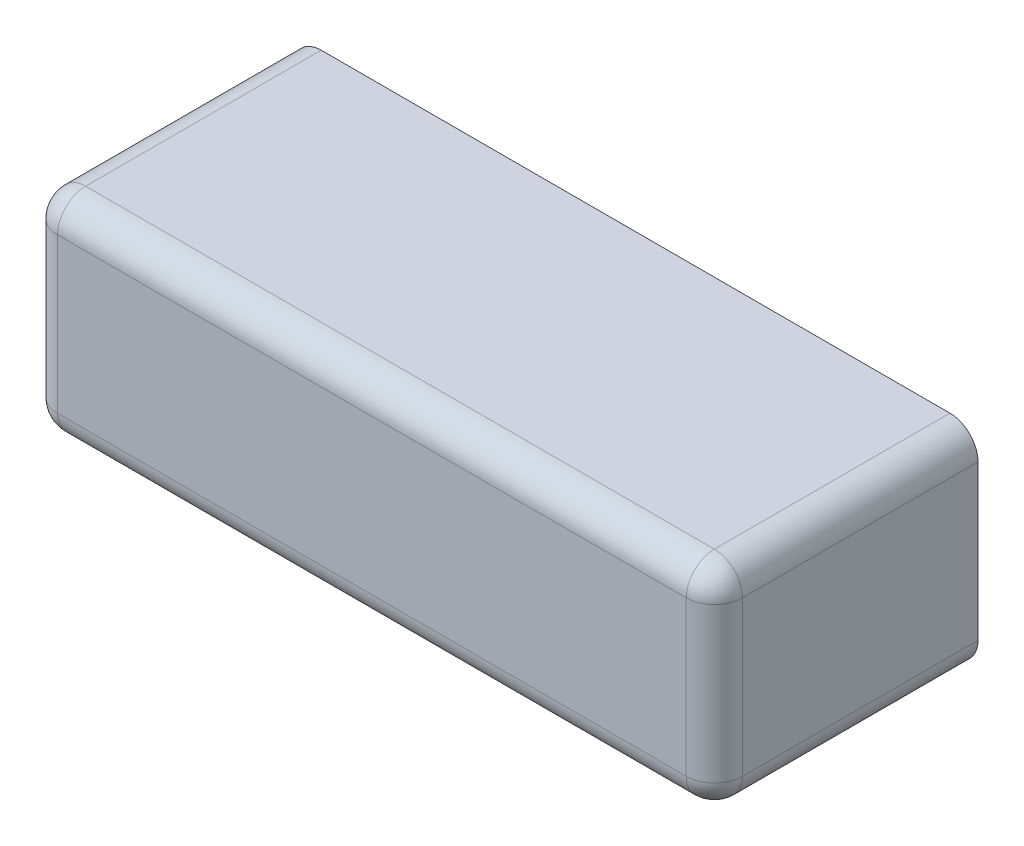
ISO-10303-21;
HEADER;
FILE_DESCRIPTION(('STEP AP214'),'2;1');
FILE_NAME('part.step','',(''),(''),'','','');
FILE_SCHEMA(('AUTOMOTIVE_DESIGN { 1 0 10303 214 1 1 1 1 }'));
ENDSEC;
DATA;
#1=APPLICATION_CONTEXT('core data for automotive mechanical design processes');
#2=APPLICATION_PROTOCOL_DEFINITION('international standard','automotive_design',2000,#1);
#3=PRODUCT_CONTEXT('',#1,'mechanical');
#4=PRODUCT('Part','Part','',(#3));
#5=PRODUCT_RELATED_PRODUCT_CATEGORY('part','',(#4));
#6=PRODUCT_DEFINITION_FORMATION('','',#4);
#7=PRODUCT_DEFINITION_CONTEXT('part definition',#1,'design');
#8=PRODUCT_DEFINITION('design','',#6,#7);
#9=PRODUCT_DEFINITION_SHAPE('','',#8);
#10=(LENGTH_UNIT() NAMED_UNIT(*) SI_UNIT(.MILLI.,.METRE.));
#11=(NAMED_UNIT(*) PLANE_ANGLE_UNIT() SI_UNIT($,.RADIAN.));
#12=(NAMED_UNIT(*) SI_UNIT($,.STERADIAN.) SOLID_ANGLE_UNIT());
#13=UNCERTAINTY_MEASURE_WITH_UNIT(LENGTH_MEASURE(1.E-05),#10,'distance_accuracy_value','');
#14=(GEOMETRIC_REPRESENTATION_CONTEXT(3) GLOBAL_UNCERTAINTY_ASSIGNED_CONTEXT((#13)) GLOBAL_UNIT_ASSIGNED_CONTEXT((#10,
#11,#12)) REPRESENTATION_CONTEXT('',''));
#15=CARTESIAN_POINT('',(0.,0.,0.));
#16=DIRECTION('',(0.,0.,1.));
#17=DIRECTION('',(1.,0.,0.));
#18=AXIS2_PLACEMENT_3D('',#15,#16,#17);
#19=CARTESIAN_POINT('',(8.95,-1.95,6.70688059247518));
#20=DIRECTION('',(1.,0.,0.));
#21=DIRECTION('',(0.,1.,0.));
#22=AXIS2_PLACEMENT_3D('',#19,#20,#21);
#23=SPHERICAL_SURFACE('',#22,0.8);
#24=CARTESIAN_POINT('',(8.95,-1.95,6.70688059247518));
#25=DIRECTION('',(0.,0.,-1.));
#26=DIRECTION('',(-1.,0.,0.));
#27=AXIS2_PLACEMENT_3D('',#24,#25,#26);
#28=CIRCLE('',#27,0.8);
#29=CARTESIAN_POINT('',(9.75,-1.95,6.70688059247518));
#30=VERTEX_POINT('',#29);
#31=CARTESIAN_POINT('',(8.95,-2.75,6.70688059247518));
#32=VERTEX_POINT('',#31);
#33=EDGE_CURVE('E103',#30,#32,#28,.T.);
#34=ORIENTED_EDGE('',*,*,#33,.F.);
#35=CARTESIAN_POINT('',(8.95,-1.95,6.70688059247518));
#36=DIRECTION('',(0.,-1.,0.));
#37=DIRECTION('',(0.,0.,-1.));
#38=AXIS2_PLACEMENT_3D('',#35,#36,#37);
#39=CIRCLE('',#38,0.8);
#40=CARTESIAN_POINT('',(8.95,-1.95,7.50688059247518));
#41=VERTEX_POINT('',#40);
#42=EDGE_CURVE('E209',#41,#30,#39,.F.);
#43=ORIENTED_EDGE('',*,*,#42,.F.);
#44=CARTESIAN_POINT('',(8.95,-1.95,6.70688059247518));
#45=DIRECTION('',(-1.,0.,0.));
#46=DIRECTION('',(0.,0.,1.));
#47=AXIS2_PLACEMENT_3D('',#44,#45,#46);
#48=CIRCLE('',#47,0.8);
#49=EDGE_CURVE('E217',#32,#41,#48,.T.);
#50=ORIENTED_EDGE('',*,*,#49,.F.);
#51=EDGE_LOOP('',(#34,#43,#50));
#52=FACE_BOUND('',#51,.T.);
#53=ADVANCED_FACE('F17',(#52),#23,.T.);
#54=CARTESIAN_POINT('',(-8.95,-1.95,6.70688059247518));
#55=DIRECTION('',(1.,0.,0.));
#56=DIRECTION('',(0.,1.,0.));
#57=AXIS2_PLACEMENT_3D('',#54,#55,#56);
#58=SPHERICAL_SURFACE('',#57,0.8);
#59=CARTESIAN_POINT('',(-8.95,-1.95,6.70688059247518));
#60=DIRECTION('',(0.,0.,-1.));
#61=DIRECTION('',(-1.,0.,0.));
#62=AXIS2_PLACEMENT_3D('',#59,#60,#61);
#63=CIRCLE('',#62,0.8);
#64=CARTESIAN_POINT('',(-8.95,-2.75,6.70688059247518));
#65=VERTEX_POINT('',#64);
#66=CARTESIAN_POINT('',(-9.75,-1.95,6.70688059247518));
#67=VERTEX_POINT('',#66);
#68=EDGE_CURVE('E202',#65,#67,#63,.T.);
#69=ORIENTED_EDGE('',*,*,#68,.F.);
#70=CARTESIAN_POINT('',(-8.95,-1.95,6.70688059247518));
#71=DIRECTION('',(-1.,0.,0.));
#72=DIRECTION('',(0.,0.,1.));
#73=AXIS2_PLACEMENT_3D('',#70,#71,#72);
#74=CIRCLE('',#73,0.8);
#75=CARTESIAN_POINT('',(-8.95,-1.95,7.50688059247518));
#76=VERTEX_POINT('',#75);
#77=EDGE_CURVE('E102',#76,#65,#74,.F.);
#78=ORIENTED_EDGE('',*,*,#77,.F.);
#79=CARTESIAN_POINT('',(-8.95,-1.95,6.70688059247518));
#80=DIRECTION('',(0.,1.,0.));
#81=DIRECTION('',(0.,0.,1.));
#82=AXIS2_PLACEMENT_3D('',#79,#80,#81);
#83=CIRCLE('',#82,0.8);
#84=EDGE_CURVE('E204',#67,#76,#83,.T.);
#85=ORIENTED_EDGE('',*,*,#84,.F.);
#86=EDGE_LOOP('',(#69,#78,#85));
#87=FACE_BOUND('',#86,.T.);
#88=ADVANCED_FACE('F239',(#87),#58,.T.);
#89=CARTESIAN_POINT('',(8.95,-1.95,7.50688059247518));
#90=DIRECTION('',(0.,0.,-1.));
#91=DIRECTION('',(-1.,0.,0.));
#92=AXIS2_PLACEMENT_3D('',#89,#90,#91);
#93=CYLINDRICAL_SURFACE('',#92,0.8);
#94=DIRECTION('',(0.,0.,1.));
#95=VECTOR('',#94,1.);
#96=CARTESIAN_POINT('',(8.95,-2.75,7.50688059247518));
#97=LINE('',#96,#95);
#98=CARTESIAN_POINT('',(8.95,-2.75,0.));
#99=VERTEX_POINT('',#98);
#100=EDGE_CURVE('E100',#32,#99,#97,.F.);
#101=ORIENTED_EDGE('',*,*,#100,.T.);
#102=CARTESIAN_POINT('',(8.95,-1.95,0.));
#103=DIRECTION('',(0.,0.,-1.));
#104=DIRECTION('',(-1.,0.,0.));
#105=AXIS2_PLACEMENT_3D('',#102,#103,#104);
#106=CIRCLE('',#105,0.8);
#107=CARTESIAN_POINT('',(9.75,-1.95,0.));
#108=VERTEX_POINT('',#107);
#109=EDGE_CURVE('E21',#99,#108,#106,.F.);
#110=ORIENTED_EDGE('',*,*,#109,.T.);
#111=DIRECTION('',(0.,0.,1.));
#112=VECTOR('',#111,1.);
#113=CARTESIAN_POINT('',(9.75,-1.95,7.50688059247518));
#114=LINE('',#113,#112);
#115=EDGE_CURVE('E98',#108,#30,#114,.T.);
#116=ORIENTED_EDGE('',*,*,#115,.T.);
#117=ORIENTED_EDGE('',*,*,#33,.T.);
#118=EDGE_LOOP('',(#101,#110,#116,#117));
#119=FACE_BOUND('',#118,.T.);
#120=ADVANCED_FACE('F97',(#119),#93,.T.);
#121=CARTESIAN_POINT('',(-9.75,-1.95,6.70688059247518));
#122=DIRECTION('',(-1.,0.,0.));
#123=DIRECTION('',(0.,0.,1.));
#124=AXIS2_PLACEMENT_3D('',#121,#122,#123);
#125=CYLINDRICAL_SURFACE('',#124,0.8);
#126=ORIENTED_EDGE('',*,*,#49,.T.);
#127=DIRECTION('',(1.,0.,0.));
#128=VECTOR('',#127,1.);
#129=CARTESIAN_POINT('',(-9.75,-1.95,7.50688059247518));
#130=LINE('',#129,#128);
#131=EDGE_CURVE('E306',#76,#41,#130,.T.);
#132=ORIENTED_EDGE('',*,*,#131,.F.);
#133=ORIENTED_EDGE('',*,*,#77,.T.);
#134=DIRECTION('',(1.,0.,0.));
#135=VECTOR('',#134,1.);
#136=CARTESIAN_POINT('',(-9.75,-2.75,6.70688059247518));
#137=LINE('',#136,#135);
#138=EDGE_CURVE('E191',#65,#32,#137,.T.);
#139=ORIENTED_EDGE('',*,*,#138,.T.);
#140=EDGE_LOOP('',(#126,#132,#133,#139));
#141=FACE_BOUND('',#140,.T.);
#142=ADVANCED_FACE('F245',(#141),#125,.T.);
#143=CARTESIAN_POINT('',(8.95,-2.75,6.70688059247518));
#144=DIRECTION('',(0.,-1.,0.));
#145=DIRECTION('',(0.,0.,-1.));
#146=AXIS2_PLACEMENT_3D('',#143,#144,#145);
#147=CYLINDRICAL_SURFACE('',#146,0.8);
#148=ORIENTED_EDGE('',*,*,#42,.T.);
#149=DIRECTION('',(0.,1.,0.));
#150=VECTOR('',#149,1.);
#151=CARTESIAN_POINT('',(9.75,-2.75,6.70688059247518));
#152=LINE('',#151,#150);
#153=CARTESIAN_POINT('',(9.75,2.45,6.70688059247518));
#154=VERTEX_POINT('',#153);
#155=EDGE_CURVE('E112',#30,#154,#152,.T.);
#156=ORIENTED_EDGE('',*,*,#155,.T.);
#157=CARTESIAN_POINT('',(8.95,2.45,6.70688059247518));
#158=DIRECTION('',(0.,-1.,0.));
#159=DIRECTION('',(0.,0.,-1.));
#160=AXIS2_PLACEMENT_3D('',#157,#158,#159);
#161=CIRCLE('',#160,0.8);
#162=CARTESIAN_POINT('',(8.95,2.45,7.50688059247518));
#163=VERTEX_POINT('',#162);
#164=EDGE_CURVE('E215',#154,#163,#161,.T.);
#165=ORIENTED_EDGE('',*,*,#164,.T.);
#166=DIRECTION('',(0.,1.,0.));
#167=VECTOR('',#166,1.);
#168=CARTESIAN_POINT('',(8.95,-2.75,7.50688059247518));
#169=LINE('',#168,#167);
#170=EDGE_CURVE('E297',#41,#163,#169,.T.);
#171=ORIENTED_EDGE('',*,*,#170,.F.);
#172=EDGE_LOOP('',(#148,#156,#165,#171));
#173=FACE_BOUND('',#172,.T.);
#174=ADVANCED_FACE('F248',(#173),#147,.T.);
#175=CARTESIAN_POINT('',(-8.95,-2.75,6.70688059247518));
#176=DIRECTION('',(0.,1.,0.));
#177=DIRECTION('',(0.,0.,1.));
#178=AXIS2_PLACEMENT_3D('',#175,#176,#177);
#179=CYLINDRICAL_SURFACE('',#178,0.8);
#180=ORIENTED_EDGE('',*,*,#84,.T.);
#181=DIRECTION('',(0.,1.,0.));
#182=VECTOR('',#181,1.);
#183=CARTESIAN_POINT('',(-8.95,-2.75,7.50688059247518));
#184=LINE('',#183,#182);
#185=CARTESIAN_POINT('',(-8.95,2.45000000000061,7.50688059247518));
#186=VERTEX_POINT('',#185);
#187=EDGE_CURVE('E173',#186,#76,#184,.F.);
#188=ORIENTED_EDGE('',*,*,#187,.F.);
#189=CARTESIAN_POINT('',(-8.95,2.45,6.70688059247518));
#190=DIRECTION('',(0.,1.,0.));
#191=DIRECTION('',(0.,0.,1.));
#192=AXIS2_PLACEMENT_3D('',#189,#190,#191);
#193=CIRCLE('',#192,0.8);
#194=CARTESIAN_POINT('',(-9.75,2.45,6.70688059247518));
#195=VERTEX_POINT('',#194);
#196=EDGE_CURVE('E207',#186,#195,#193,.F.);
#197=ORIENTED_EDGE('',*,*,#196,.T.);
#198=DIRECTION('',(0.,1.,0.));
#199=VECTOR('',#198,1.);
#200=CARTESIAN_POINT('',(-9.75,3.25,6.70688059247518));
#201=LINE('',#200,#199);
#202=EDGE_CURVE('E144',#195,#67,#201,.F.);
#203=ORIENTED_EDGE('',*,*,#202,.T.);
#204=EDGE_LOOP('',(#180,#188,#197,#203));
#205=FACE_BOUND('',#204,.T.);
#206=ADVANCED_FACE('F252',(#205),#179,.T.);
#207=CARTESIAN_POINT('',(-8.95,-1.95,7.50688059247518));
#208=DIRECTION('',(0.,0.,-1.));
#209=DIRECTION('',(-1.,0.,0.));
#210=AXIS2_PLACEMENT_3D('',#207,#208,#209);
#211=CYLINDRICAL_SURFACE('',#210,0.8);
#212=DIRECTION('',(0.,0.,-1.));
#213=VECTOR('',#212,1.);
#214=CARTESIAN_POINT('',(-9.75,-1.95,7.50688059247518));
#215=LINE('',#214,#213);
#216=CARTESIAN_POINT('',(-9.75,-1.95,0.));
#217=VERTEX_POINT('',#216);
#218=EDGE_CURVE('E128',#67,#217,#215,.T.);
#219=ORIENTED_EDGE('',*,*,#218,.T.);
#220=CARTESIAN_POINT('',(-8.95,-1.95,0.));
#221=DIRECTION('',(0.,0.,-1.));
#222=DIRECTION('',(-1.,0.,0.));
#223=AXIS2_PLACEMENT_3D('',#220,#221,#222);
#224=CIRCLE('',#223,0.8);
#225=CARTESIAN_POINT('',(-8.95,-2.75,0.));
#226=VERTEX_POINT('',#225);
#227=EDGE_CURVE('E192',#217,#226,#224,.F.);
#228=ORIENTED_EDGE('',*,*,#227,.T.);
#229=DIRECTION('',(0.,0.,1.));
#230=VECTOR('',#229,1.);
#231=CARTESIAN_POINT('',(-8.95,-2.75,7.50688059247518));
#232=LINE('',#231,#230);
#233=EDGE_CURVE('E188',#226,#65,#232,.T.);
#234=ORIENTED_EDGE('',*,*,#233,.T.);
#235=ORIENTED_EDGE('',*,*,#68,.T.);
#236=EDGE_LOOP('',(#219,#228,#234,#235));
#237=FACE_BOUND('',#236,.T.);
#238=ADVANCED_FACE('F256',(#237),#211,.T.);
#239=CARTESIAN_POINT('',(-9.75,-2.75,7.50688059247518));
#240=DIRECTION('',(0.,1.,0.));
#241=DIRECTION('',(0.,0.,1.));
#242=AXIS2_PLACEMENT_3D('',#239,#240,#241);
#243=PLANE('',#242);
#244=ORIENTED_EDGE('',*,*,#138,.F.);
#245=ORIENTED_EDGE('',*,*,#233,.F.);
#246=DIRECTION('',(1.,0.,0.));
#247=VECTOR('',#246,1.);
#248=CARTESIAN_POINT('',(-9.75,-2.75,0.));
#249=LINE('',#248,#247);
#250=EDGE_CURVE('E118',#226,#99,#249,.T.);
#251=ORIENTED_EDGE('',*,*,#250,.T.);
#252=ORIENTED_EDGE('',*,*,#100,.F.);
#253=EDGE_LOOP('',(#244,#245,#251,#252));
#254=FACE_BOUND('',#253,.T.);
#255=ADVANCED_FACE('F260',(#254),#243,.F.);
#256=CARTESIAN_POINT('',(9.75,-2.75,7.50688059247518));
#257=DIRECTION('',(-1.,0.,0.));
#258=DIRECTION('',(0.,0.,1.));
#259=AXIS2_PLACEMENT_3D('',#256,#257,#258);
#260=PLANE('',#259);
#261=ORIENTED_EDGE('',*,*,#155,.F.);
#262=ORIENTED_EDGE('',*,*,#115,.F.);
#263=DIRECTION('',(0.,1.,0.));
#264=VECTOR('',#263,1.);
#265=CARTESIAN_POINT('',(9.75,-2.75,0.));
#266=LINE('',#265,#264);
#267=CARTESIAN_POINT('',(9.75,2.45,0.));
#268=VERTEX_POINT('',#267);
#269=EDGE_CURVE('E109',#108,#268,#266,.T.);
#270=ORIENTED_EDGE('',*,*,#269,.T.);
#271=DIRECTION('',(0.,0.,-1.));
#272=VECTOR('',#271,1.);
#273=CARTESIAN_POINT('',(9.75,2.45,7.50688059247518));
#274=LINE('',#273,#272);
#275=EDGE_CURVE('E121',#154,#268,#274,.T.);
#276=ORIENTED_EDGE('',*,*,#275,.F.);
#277=EDGE_LOOP('',(#261,#262,#270,#276));
#278=FACE_BOUND('',#277,.T.);
#279=ADVANCED_FACE('F107',(#278),#260,.F.);
#280=CARTESIAN_POINT('',(-9.75,-2.75,7.50688059247518));
#281=DIRECTION('',(0.,0.,1.));
#282=DIRECTION('',(1.,0.,0.));
#283=AXIS2_PLACEMENT_3D('',#280,#281,#282);
#284=PLANE('',#283);
#285=ORIENTED_EDGE('',*,*,#170,.T.);
#286=DIRECTION('',(1.,0.,0.));
#287=VECTOR('',#286,1.);
#288=CARTESIAN_POINT('',(-9.75,2.45,7.50688059247518));
#289=LINE('',#288,#287);
#290=EDGE_CURVE('E179',#186,#163,#289,.T.);
#291=ORIENTED_EDGE('',*,*,#290,.F.);
#292=ORIENTED_EDGE('',*,*,#187,.T.);
#293=ORIENTED_EDGE('',*,*,#131,.T.);
#294=EDGE_LOOP('',(#285,#291,#292,#293));
#295=FACE_BOUND('',#294,.T.);
#296=ADVANCED_FACE('F161',(#295),#284,.T.);
#297=CARTESIAN_POINT('',(8.95,2.45,6.70688059247518));
#298=DIRECTION('',(1.,0.,0.));
#299=DIRECTION('',(0.,1.,0.));
#300=AXIS2_PLACEMENT_3D('',#297,#298,#299);
#301=SPHERICAL_SURFACE('',#300,0.8);
#302=CARTESIAN_POINT('',(8.95,2.45,6.70688059247518));
#303=DIRECTION('',(1.,0.,0.));
#304=DIRECTION('',(0.,0.,-1.));
#305=AXIS2_PLACEMENT_3D('',#302,#303,#304);
#306=CIRCLE('',#305,0.8);
#307=CARTESIAN_POINT('',(8.95,3.25,6.70688059247518));
#308=VERTEX_POINT('',#307);
#309=EDGE_CURVE('E139',#163,#308,#306,.F.);
#310=ORIENTED_EDGE('',*,*,#309,.F.);
#311=ORIENTED_EDGE('',*,*,#164,.F.);
#312=CARTESIAN_POINT('',(8.95,2.45,6.70688059247518));
#313=DIRECTION('',(0.,0.,-1.));
#314=DIRECTION('',(-1.,0.,0.));
#315=AXIS2_PLACEMENT_3D('',#312,#313,#314);
#316=CIRCLE('',#315,0.8);
#317=EDGE_CURVE('E117',#308,#154,#316,.T.);
#318=ORIENTED_EDGE('',*,*,#317,.F.);
#319=EDGE_LOOP('',(#310,#311,#318));
#320=FACE_BOUND('',#319,.T.);
#321=ADVANCED_FACE('F156',(#320),#301,.T.);
#322=CARTESIAN_POINT('',(-9.75,3.25,7.50688059247518));
#323=DIRECTION('',(1.,0.,0.));
#324=DIRECTION('',(0.,0.,-1.));
#325=AXIS2_PLACEMENT_3D('',#322,#323,#324);
#326=PLANE('',#325);
#327=ORIENTED_EDGE('',*,*,#202,.F.);
#328=DIRECTION('',(0.,0.,-1.));
#329=VECTOR('',#328,1.);
#330=CARTESIAN_POINT('',(-9.75,2.45,7.50688059247518));
#331=LINE('',#330,#329);
#332=CARTESIAN_POINT('',(-9.75,2.45,0.));
#333=VERTEX_POINT('',#332);
#334=EDGE_CURVE('E137',#333,#195,#331,.F.);
#335=ORIENTED_EDGE('',*,*,#334,.F.);
#336=DIRECTION('',(0.,1.,0.));
#337=VECTOR('',#336,1.);
#338=CARTESIAN_POINT('',(-9.75,-2.75,0.));
#339=LINE('',#338,#337);
#340=EDGE_CURVE('E123',#333,#217,#339,.F.);
#341=ORIENTED_EDGE('',*,*,#340,.T.);
#342=ORIENTED_EDGE('',*,*,#218,.F.);
#343=EDGE_LOOP('',(#327,#335,#341,#342));
#344=FACE_BOUND('',#343,.T.);
#345=ADVANCED_FACE('F151',(#344),#326,.F.);
#346=CARTESIAN_POINT('',(-8.95,2.45,6.70688059247518));
#347=DIRECTION('',(1.,0.,0.));
#348=DIRECTION('',(0.,1.,0.));
#349=AXIS2_PLACEMENT_3D('',#346,#347,#348);
#350=SPHERICAL_SURFACE('',#349,0.8);
#351=CARTESIAN_POINT('',(-8.95,2.45,6.70688059247518));
#352=DIRECTION('',(0.,0.,-1.));
#353=DIRECTION('',(-1.,0.,0.));
#354=AXIS2_PLACEMENT_3D('',#351,#352,#353);
#355=CIRCLE('',#354,0.8);
#356=CARTESIAN_POINT('',(-8.95,3.25,6.70688059247518));
#357=VERTEX_POINT('',#356);
#358=EDGE_CURVE('E35',#195,#357,#355,.T.);
#359=ORIENTED_EDGE('',*,*,#358,.F.);
#360=ORIENTED_EDGE('',*,*,#196,.F.);
#361=CARTESIAN_POINT('',(-8.95,2.45,6.70688059247518));
#362=DIRECTION('',(1.,0.,0.));
#363=DIRECTION('',(0.,0.,-1.));
#364=AXIS2_PLACEMENT_3D('',#361,#362,#363);
#365=CIRCLE('',#364,0.8);
#366=EDGE_CURVE('E313',#357,#186,#365,.T.);
#367=ORIENTED_EDGE('',*,*,#366,.F.);
#368=EDGE_LOOP('',(#359,#360,#367));
#369=FACE_BOUND('',#368,.T.);
#370=ADVANCED_FACE('F147',(#369),#350,.T.);
#371=CARTESIAN_POINT('',(-9.75,-2.75,0.));
#372=DIRECTION('',(0.,0.,1.));
#373=DIRECTION('',(1.,0.,0.));
#374=AXIS2_PLACEMENT_3D('',#371,#372,#373);
#375=PLANE('',#374);
#376=CARTESIAN_POINT('',(8.95,2.45,0.));
#377=DIRECTION('',(0.,0.,-1.));
#378=DIRECTION('',(-1.,0.,0.));
#379=AXIS2_PLACEMENT_3D('',#376,#377,#378);
#380=CIRCLE('',#379,0.8);
#381=CARTESIAN_POINT('',(8.95,3.25,0.));
#382=VERTEX_POINT('',#381);
#383=EDGE_CURVE('E116',#268,#382,#380,.F.);
#384=ORIENTED_EDGE('',*,*,#383,.F.);
#385=ORIENTED_EDGE('',*,*,#269,.F.);
#386=ORIENTED_EDGE('',*,*,#109,.F.);
#387=ORIENTED_EDGE('',*,*,#250,.F.);
#388=ORIENTED_EDGE('',*,*,#227,.F.);
#389=ORIENTED_EDGE('',*,*,#340,.F.);
#390=CARTESIAN_POINT('',(-8.95,2.45,0.));
#391=DIRECTION('',(0.,0.,-1.));
#392=DIRECTION('',(-1.,0.,0.));
#393=AXIS2_PLACEMENT_3D('',#390,#391,#392);
#394=CIRCLE('',#393,0.8);
#395=CARTESIAN_POINT('',(-8.95,3.25,0.));
#396=VERTEX_POINT('',#395);
#397=EDGE_CURVE('E131',#396,#333,#394,.F.);
#398=ORIENTED_EDGE('',*,*,#397,.F.);
#399=DIRECTION('',(1.,0.,0.));
#400=VECTOR('',#399,1.);
#401=CARTESIAN_POINT('',(9.75,3.25,0.));
#402=LINE('',#401,#400);
#403=EDGE_CURVE('E129',#396,#382,#402,.T.);
#404=ORIENTED_EDGE('',*,*,#403,.T.);
#405=EDGE_LOOP('',(#384,#385,#386,#387,#388,#389,#398,#404));
#406=FACE_BOUND('',#405,.T.);
#407=ADVANCED_FACE('F114',(#406),#375,.F.);
#408=CARTESIAN_POINT('',(8.95,2.45,7.50688059247518));
#409=DIRECTION('',(0.,0.,-1.));
#410=DIRECTION('',(-1.,0.,0.));
#411=AXIS2_PLACEMENT_3D('',#408,#409,#410);
#412=CYLINDRICAL_SURFACE('',#411,0.8);
#413=ORIENTED_EDGE('',*,*,#275,.T.);
#414=ORIENTED_EDGE('',*,*,#383,.T.);
#415=DIRECTION('',(0.,0.,-1.));
#416=VECTOR('',#415,1.);
#417=CARTESIAN_POINT('',(8.95,3.25,7.50688059247518));
#418=LINE('',#417,#416);
#419=EDGE_CURVE('E130',#382,#308,#418,.F.);
#420=ORIENTED_EDGE('',*,*,#419,.T.);
#421=ORIENTED_EDGE('',*,*,#317,.T.);
#422=EDGE_LOOP('',(#413,#414,#420,#421));
#423=FACE_BOUND('',#422,.T.);
#424=ADVANCED_FACE('F283',(#423),#412,.T.);
#425=CARTESIAN_POINT('',(-9.75,2.45,6.70688059247518));
#426=DIRECTION('',(1.,0.,0.));
#427=DIRECTION('',(0.,0.,-1.));
#428=AXIS2_PLACEMENT_3D('',#425,#426,#427);
#429=CYLINDRICAL_SURFACE('',#428,0.8);
#430=ORIENTED_EDGE('',*,*,#309,.T.);
#431=DIRECTION('',(1.,0.,0.));
#432=VECTOR('',#431,1.);
#433=CARTESIAN_POINT('',(9.75,3.25,6.70688059247518));
#434=LINE('',#433,#432);
#435=EDGE_CURVE('E27',#308,#357,#434,.F.);
#436=ORIENTED_EDGE('',*,*,#435,.T.);
#437=ORIENTED_EDGE('',*,*,#366,.T.);
#438=ORIENTED_EDGE('',*,*,#290,.T.);
#439=EDGE_LOOP('',(#430,#436,#437,#438));
#440=FACE_BOUND('',#439,.T.);
#441=ADVANCED_FACE('F278',(#440),#429,.T.);
#442=CARTESIAN_POINT('',(-8.95,2.45,7.50688059247518));
#443=DIRECTION('',(0.,0.,-1.));
#444=DIRECTION('',(-1.,0.,0.));
#445=AXIS2_PLACEMENT_3D('',#442,#443,#444);
#446=CYLINDRICAL_SURFACE('',#445,0.8);
#447=DIRECTION('',(0.,0.,-1.));
#448=VECTOR('',#447,1.);
#449=CARTESIAN_POINT('',(-8.95,3.25,7.50688059247518));
#450=LINE('',#449,#448);
#451=EDGE_CURVE('E11',#357,#396,#450,.T.);
#452=ORIENTED_EDGE('',*,*,#451,.T.);
#453=ORIENTED_EDGE('',*,*,#397,.T.);
#454=ORIENTED_EDGE('',*,*,#334,.T.);
#455=ORIENTED_EDGE('',*,*,#358,.T.);
#456=EDGE_LOOP('',(#452,#453,#454,#455));
#457=FACE_BOUND('',#456,.T.);
#458=ADVANCED_FACE('F272',(#457),#446,.T.);
#459=CARTESIAN_POINT('',(9.75,3.25,7.50688059247518));
#460=DIRECTION('',(0.,-1.,0.));
#461=DIRECTION('',(0.,0.,-1.));
#462=AXIS2_PLACEMENT_3D('',#459,#460,#461);
#463=PLANE('',#462);
#464=ORIENTED_EDGE('',*,*,#435,.F.);
#465=ORIENTED_EDGE('',*,*,#419,.F.);
#466=ORIENTED_EDGE('',*,*,#403,.F.);
#467=ORIENTED_EDGE('',*,*,#451,.F.);
#468=EDGE_LOOP('',(#464,#465,#466,#467));
#469=FACE_BOUND('',#468,.T.);
#470=ADVANCED_FACE('F270',(#469),#463,.F.);
#471=CLOSED_SHELL('',(#53,#88,#120,#142,#174,#206,#238,#255,#279,#296,#321,#345,#370,#407,#424,
#441,#458,#470));
#472=MANIFOLD_SOLID_BREP('B1',#471);
#473=ADVANCED_BREP_SHAPE_REPRESENTATION('',(#18,#472),#14);
#474=SHAPE_DEFINITION_REPRESENTATION(#9,#473);
ENDSEC;
END-ISO-10303-21;
